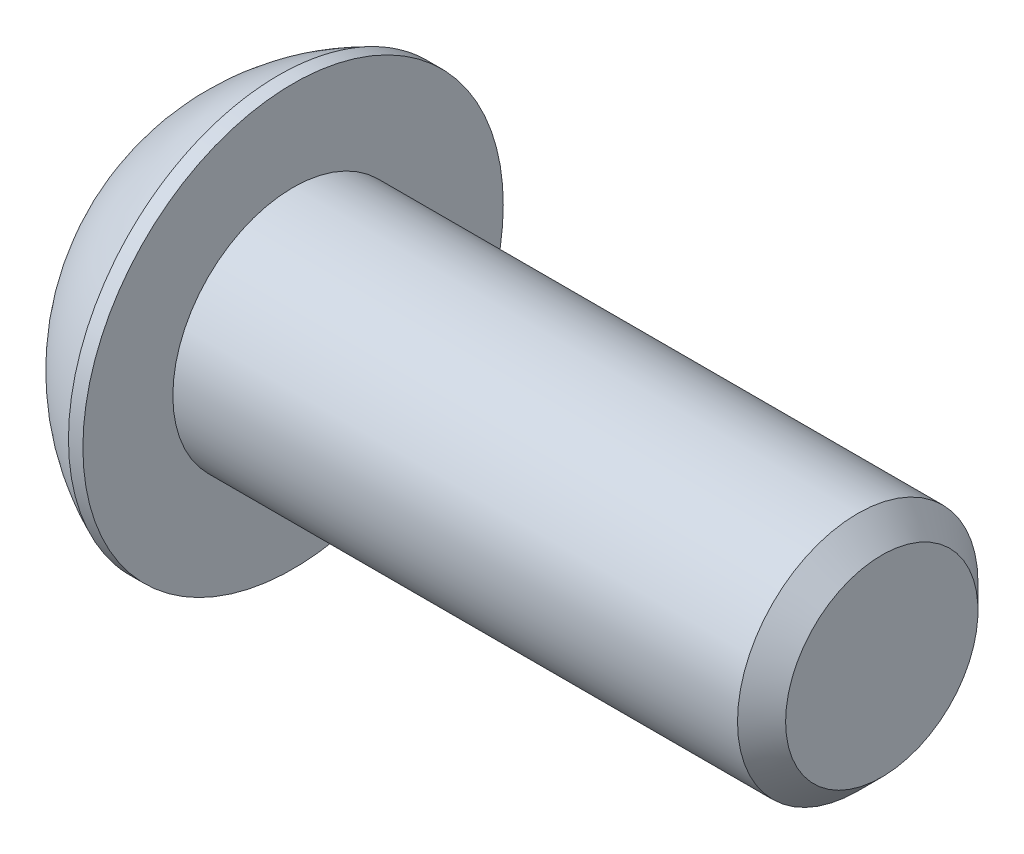
ISO-10303-21;
HEADER;
FILE_DESCRIPTION(('STEP AP214'),'2;1');
FILE_NAME('part.step','',(''),(''),'','','');
FILE_SCHEMA(('AUTOMOTIVE_DESIGN { 1 0 10303 214 1 1 1 1 }'));
ENDSEC;
DATA;
#1=APPLICATION_CONTEXT('core data for automotive mechanical design processes');
#2=APPLICATION_PROTOCOL_DEFINITION('international standard','automotive_design',2000,#1);
#3=PRODUCT_CONTEXT('',#1,'mechanical');
#4=PRODUCT('Part','Part','',(#3));
#5=PRODUCT_RELATED_PRODUCT_CATEGORY('part','',(#4));
#6=PRODUCT_DEFINITION_FORMATION('','',#4);
#7=PRODUCT_DEFINITION_CONTEXT('part definition',#1,'design');
#8=PRODUCT_DEFINITION('design','',#6,#7);
#9=PRODUCT_DEFINITION_SHAPE('','',#8);
#10=(LENGTH_UNIT() NAMED_UNIT(*) SI_UNIT(.MILLI.,.METRE.));
#11=(NAMED_UNIT(*) PLANE_ANGLE_UNIT() SI_UNIT($,.RADIAN.));
#12=(NAMED_UNIT(*) SI_UNIT($,.STERADIAN.) SOLID_ANGLE_UNIT());
#13=UNCERTAINTY_MEASURE_WITH_UNIT(LENGTH_MEASURE(1.E-05),#10,'distance_accuracy_value','');
#14=(GEOMETRIC_REPRESENTATION_CONTEXT(3) GLOBAL_UNCERTAINTY_ASSIGNED_CONTEXT((#13)) GLOBAL_UNIT_ASSIGNED_CONTEXT((#10,
#11,#12)) REPRESENTATION_CONTEXT('',''));
#15=CARTESIAN_POINT('',(0.,0.,0.));
#16=DIRECTION('',(0.,0.,1.));
#17=DIRECTION('',(1.,0.,0.));
#18=AXIS2_PLACEMENT_3D('',#15,#16,#17);
#19=CARTESIAN_POINT('',(1.32080000000034,0.,0.));
#20=DIRECTION('',(-1.,0.,0.));
#21=DIRECTION('',(0.,0.,1.));
#22=AXIS2_PLACEMENT_3D('',#19,#20,#21);
#23=CONICAL_SURFACE('',#22,1.1937999999998,1.04719755119608);
#24=CARTESIAN_POINT('',(2.01004075135902,0.,-4.44089209850063E-13));
#25=VERTEX_POINT('',#24);
#26=VERTEX_LOOP('',#25);
#27=FACE_BOUND('',#26,.T.);
#28=CARTESIAN_POINT('',(1.32080000000009,0.,0.));
#29=DIRECTION('',(-1.,0.,0.));
#30=DIRECTION('',(0.,0.,1.));
#31=AXIS2_PLACEMENT_3D('',#28,#29,#30);
#32=CIRCLE('',#31,1.19380000000024);
#33=CARTESIAN_POINT('',(1.32080000000009,0.,1.19380000000024));
#34=VERTEX_POINT('',#33);
#35=EDGE_CURVE('E20',#34,#34,#32,.T.);
#36=ORIENTED_EDGE('',*,*,#35,.T.);
#37=EDGE_LOOP('',(#36));
#38=FACE_BOUND('',#37,.T.);
#39=ADVANCED_FACE('F17',(#27,#38),#23,.F.);
#40=CARTESIAN_POINT('',(1.3208,-2.29135888084633,0.));
#41=DIRECTION('',(1.,0.,0.));
#42=DIRECTION('',(0.,0.,-1.));
#43=AXIS2_PLACEMENT_3D('',#40,#41,#42);
#44=PLANE('',#43);
#45=DIRECTION('',(0.,1.,0.));
#46=VECTOR('',#45,1.);
#47=CARTESIAN_POINT('',(1.3208,-1.14567944042316,1.984375));
#48=LINE('',#47,#46);
#49=CARTESIAN_POINT('',(1.3208,1.14567944042316,1.984375));
#50=VERTEX_POINT('',#49);
#51=CARTESIAN_POINT('',(1.3208,-1.14567944042316,1.984375));
#52=VERTEX_POINT('',#51);
#53=EDGE_CURVE('E69',#50,#52,#48,.F.);
#54=ORIENTED_EDGE('',*,*,#53,.F.);
#55=DIRECTION('',(0.,0.5,-0.866025403784439));
#56=VECTOR('',#55,1.);
#57=CARTESIAN_POINT('',(1.3208,1.14567944042316,1.984375));
#58=LINE('',#57,#56);
#59=CARTESIAN_POINT('',(1.3208,2.29135888084633,0.));
#60=VERTEX_POINT('',#59);
#61=EDGE_CURVE('E287',#60,#50,#58,.F.);
#62=ORIENTED_EDGE('',*,*,#61,.F.);
#63=DIRECTION('',(0.,-0.5,-0.866025403784439));
#64=VECTOR('',#63,1.);
#65=CARTESIAN_POINT('',(1.3208,2.29135888084633,0.));
#66=LINE('',#65,#64);
#67=CARTESIAN_POINT('',(1.3208,1.14567944042316,-1.984375));
#68=VERTEX_POINT('',#67);
#69=EDGE_CURVE('E291',#68,#60,#66,.F.);
#70=ORIENTED_EDGE('',*,*,#69,.F.);
#71=DIRECTION('',(0.,1.,0.));
#72=VECTOR('',#71,1.);
#73=CARTESIAN_POINT('',(1.3208,1.14567944042316,-1.984375));
#74=LINE('',#73,#72);
#75=CARTESIAN_POINT('',(1.3208,-1.14567944042316,-1.984375));
#76=VERTEX_POINT('',#75);
#77=EDGE_CURVE('E296',#76,#68,#74,.T.);
#78=ORIENTED_EDGE('',*,*,#77,.F.);
#79=DIRECTION('',(0.,-0.500000000000001,0.866025403784438));
#80=VECTOR('',#79,1.);
#81=CARTESIAN_POINT('',(1.3208,-1.14567944042316,-1.984375));
#82=LINE('',#81,#80);
#83=CARTESIAN_POINT('',(1.3208,-2.29135888084633,0.));
#84=VERTEX_POINT('',#83);
#85=EDGE_CURVE('E301',#84,#76,#82,.F.);
#86=ORIENTED_EDGE('',*,*,#85,.F.);
#87=DIRECTION('',(0.,0.500000000000001,0.866025403784438));
#88=VECTOR('',#87,1.);
#89=CARTESIAN_POINT('',(1.3208,-2.29135888084633,0.));
#90=LINE('',#89,#88);
#91=EDGE_CURVE('E82',#52,#84,#90,.F.);
#92=ORIENTED_EDGE('',*,*,#91,.F.);
#93=EDGE_LOOP('',(#54,#62,#70,#78,#86,#92));
#94=FACE_BOUND('',#93,.T.);
#95=ORIENTED_EDGE('',*,*,#35,.F.);
#96=EDGE_LOOP('',(#95));
#97=FACE_BOUND('',#96,.T.);
#98=ADVANCED_FACE('F75',(#94,#97),#44,.F.);
#99=CARTESIAN_POINT('',(1.3208,-1.14567944042316,1.984375));
#100=DIRECTION('',(0.,0.,-1.));
#101=DIRECTION('',(0.,1.,0.));
#102=AXIS2_PLACEMENT_3D('',#99,#100,#101);
#103=PLANE('',#102);
#104=ORIENTED_EDGE('',*,*,#53,.T.);
#105=DIRECTION('',(1.,0.,0.));
#106=VECTOR('',#105,1.);
#107=CARTESIAN_POINT('',(1.3208,-1.14567944042316,1.984375));
#108=LINE('',#107,#106);
#109=CARTESIAN_POINT('',(0.,-1.14567944042316,1.984375));
#110=VERTEX_POINT('',#109);
#111=EDGE_CURVE('E79',#110,#52,#108,.T.);
#112=ORIENTED_EDGE('',*,*,#111,.F.);
#113=DIRECTION('',(0.,1.,0.));
#114=VECTOR('',#113,1.);
#115=CARTESIAN_POINT('',(0.,0.,1.984375));
#116=LINE('',#115,#114);
#117=CARTESIAN_POINT('',(0.,1.14567944042316,1.984375));
#118=VERTEX_POINT('',#117);
#119=EDGE_CURVE('E281',#118,#110,#116,.F.);
#120=ORIENTED_EDGE('',*,*,#119,.F.);
#121=DIRECTION('',(1.,0.,0.));
#122=VECTOR('',#121,1.);
#123=CARTESIAN_POINT('',(1.3208,1.14567944042316,1.984375));
#124=LINE('',#123,#122);
#125=EDGE_CURVE('E284',#50,#118,#124,.F.);
#126=ORIENTED_EDGE('',*,*,#125,.F.);
#127=EDGE_LOOP('',(#104,#112,#120,#126));
#128=FACE_BOUND('',#127,.T.);
#129=ADVANCED_FACE('F128',(#128),#103,.T.);
#130=CARTESIAN_POINT('',(1.3208,-2.29135888084633,0.));
#131=DIRECTION('',(0.,0.866025403784438,-0.500000000000001));
#132=DIRECTION('',(0.,0.500000000000001,0.866025403784438));
#133=AXIS2_PLACEMENT_3D('',#130,#131,#132);
#134=PLANE('',#133);
#135=ORIENTED_EDGE('',*,*,#91,.T.);
#136=DIRECTION('',(1.,0.,0.));
#137=VECTOR('',#136,1.);
#138=CARTESIAN_POINT('',(1.3208,-2.29135888084633,0.));
#139=LINE('',#138,#137);
#140=CARTESIAN_POINT('',(0.,-2.29135888084633,0.));
#141=VERTEX_POINT('',#140);
#142=EDGE_CURVE('E303',#141,#84,#139,.T.);
#143=ORIENTED_EDGE('',*,*,#142,.F.);
#144=DIRECTION('',(0.,-0.500000000000001,-0.866025403784438));
#145=VECTOR('',#144,1.);
#146=CARTESIAN_POINT('',(0.,-1.14567944042316,1.984375));
#147=LINE('',#146,#145);
#148=EDGE_CURVE('E278',#110,#141,#147,.T.);
#149=ORIENTED_EDGE('',*,*,#148,.F.);
#150=ORIENTED_EDGE('',*,*,#111,.T.);
#151=EDGE_LOOP('',(#135,#143,#149,#150));
#152=FACE_BOUND('',#151,.T.);
#153=ADVANCED_FACE('F124',(#152),#134,.T.);
#154=CARTESIAN_POINT('',(1.3208,-1.14567944042316,-1.984375));
#155=DIRECTION('',(0.,0.866025403784438,0.500000000000001));
#156=DIRECTION('',(0.,-0.500000000000001,0.866025403784438));
#157=AXIS2_PLACEMENT_3D('',#154,#155,#156);
#158=PLANE('',#157);
#159=ORIENTED_EDGE('',*,*,#85,.T.);
#160=DIRECTION('',(1.,0.,0.));
#161=VECTOR('',#160,1.);
#162=CARTESIAN_POINT('',(1.3208,-1.14567944042316,-1.984375));
#163=LINE('',#162,#161);
#164=CARTESIAN_POINT('',(0.,-1.14567944042316,-1.984375));
#165=VERTEX_POINT('',#164);
#166=EDGE_CURVE('E298',#165,#76,#163,.T.);
#167=ORIENTED_EDGE('',*,*,#166,.F.);
#168=DIRECTION('',(0.,0.500000000000001,-0.866025403784438));
#169=VECTOR('',#168,1.);
#170=CARTESIAN_POINT('',(0.,-2.29135888084633,0.));
#171=LINE('',#170,#169);
#172=EDGE_CURVE('E275',#141,#165,#171,.T.);
#173=ORIENTED_EDGE('',*,*,#172,.F.);
#174=ORIENTED_EDGE('',*,*,#142,.T.);
#175=EDGE_LOOP('',(#159,#167,#173,#174));
#176=FACE_BOUND('',#175,.T.);
#177=ADVANCED_FACE('F120',(#176),#158,.T.);
#178=CARTESIAN_POINT('',(1.3208,1.14567944042316,-1.984375));
#179=DIRECTION('',(0.,0.,1.));
#180=DIRECTION('',(1.,0.,0.));
#181=AXIS2_PLACEMENT_3D('',#178,#179,#180);
#182=PLANE('',#181);
#183=ORIENTED_EDGE('',*,*,#77,.T.);
#184=DIRECTION('',(1.,0.,0.));
#185=VECTOR('',#184,1.);
#186=CARTESIAN_POINT('',(1.3208,1.14567944042316,-1.984375));
#187=LINE('',#186,#185);
#188=CARTESIAN_POINT('',(0.,1.14567944042316,-1.984375));
#189=VERTEX_POINT('',#188);
#190=EDGE_CURVE('E293',#189,#68,#187,.T.);
#191=ORIENTED_EDGE('',*,*,#190,.F.);
#192=DIRECTION('',(0.,1.,0.));
#193=VECTOR('',#192,1.);
#194=CARTESIAN_POINT('',(0.,0.,-1.984375));
#195=LINE('',#194,#193);
#196=EDGE_CURVE('E272',#165,#189,#195,.T.);
#197=ORIENTED_EDGE('',*,*,#196,.F.);
#198=ORIENTED_EDGE('',*,*,#166,.T.);
#199=EDGE_LOOP('',(#183,#191,#197,#198));
#200=FACE_BOUND('',#199,.T.);
#201=ADVANCED_FACE('F117',(#200),#182,.T.);
#202=CARTESIAN_POINT('',(1.3208,2.29135888084633,0.));
#203=DIRECTION('',(0.,-0.866025403784439,0.5));
#204=DIRECTION('',(0.,-0.5,-0.866025403784439));
#205=AXIS2_PLACEMENT_3D('',#202,#203,#204);
#206=PLANE('',#205);
#207=ORIENTED_EDGE('',*,*,#69,.T.);
#208=DIRECTION('',(1.,0.,0.));
#209=VECTOR('',#208,1.);
#210=CARTESIAN_POINT('',(1.3208,2.29135888084633,0.));
#211=LINE('',#210,#209);
#212=CARTESIAN_POINT('',(0.,2.29135888084633,0.));
#213=VERTEX_POINT('',#212);
#214=EDGE_CURVE('E35',#213,#60,#211,.T.);
#215=ORIENTED_EDGE('',*,*,#214,.F.);
#216=DIRECTION('',(0.,0.5,0.866025403784439));
#217=VECTOR('',#216,1.);
#218=CARTESIAN_POINT('',(0.,1.14567944042316,-1.984375));
#219=LINE('',#218,#217);
#220=EDGE_CURVE('E269',#189,#213,#219,.T.);
#221=ORIENTED_EDGE('',*,*,#220,.F.);
#222=ORIENTED_EDGE('',*,*,#190,.T.);
#223=EDGE_LOOP('',(#207,#215,#221,#222));
#224=FACE_BOUND('',#223,.T.);
#225=ADVANCED_FACE('F113',(#224),#206,.T.);
#226=CARTESIAN_POINT('',(1.3208,1.14567944042316,1.984375));
#227=DIRECTION('',(0.,-0.866025403784439,-0.5));
#228=DIRECTION('',(0.,0.5,-0.866025403784439));
#229=AXIS2_PLACEMENT_3D('',#226,#227,#228);
#230=PLANE('',#229);
#231=ORIENTED_EDGE('',*,*,#61,.T.);
#232=ORIENTED_EDGE('',*,*,#125,.T.);
#233=DIRECTION('',(0.,-0.5,0.866025403784438));
#234=VECTOR('',#233,1.);
#235=CARTESIAN_POINT('',(0.,2.29135888084633,0.));
#236=LINE('',#235,#234);
#237=EDGE_CURVE('E100',#213,#118,#236,.T.);
#238=ORIENTED_EDGE('',*,*,#237,.F.);
#239=ORIENTED_EDGE('',*,*,#214,.T.);
#240=EDGE_LOOP('',(#231,#232,#238,#239));
#241=FACE_BOUND('',#240,.T.);
#242=ADVANCED_FACE('F109',(#241),#230,.T.);
#243=CARTESIAN_POINT('',(0.,0.,0.));
#244=DIRECTION('',(-1.,0.,0.));
#245=DIRECTION('',(0.,0.,1.));
#246=AXIS2_PLACEMENT_3D('',#243,#244,#245);
#247=PLANE('',#246);
#248=ORIENTED_EDGE('',*,*,#220,.T.);
#249=ORIENTED_EDGE('',*,*,#237,.T.);
#250=ORIENTED_EDGE('',*,*,#119,.T.);
#251=ORIENTED_EDGE('',*,*,#148,.T.);
#252=ORIENTED_EDGE('',*,*,#172,.T.);
#253=ORIENTED_EDGE('',*,*,#196,.T.);
#254=EDGE_LOOP('',(#248,#249,#250,#251,#252,#253));
#255=FACE_BOUND('',#254,.T.);
#256=CARTESIAN_POINT('',(0.,2.77495,0.));
#257=CARTESIAN_POINT('',(0.,2.77494953309947,0.0779118937523459));
#258=CARTESIAN_POINT('',(0.,2.77166578388025,0.15583810591977));
#259=CARTESIAN_POINT('',(0.,2.75855213600204,0.311152012455904));
#260=CARTESIAN_POINT('',(0.,2.74872030471467,0.388539541019556));
#261=CARTESIAN_POINT('',(0.,2.72255472645676,0.542341518735717));
#262=CARTESIAN_POINT('',(-2.70414110576258E-13,2.70621065843663,0.618754223567578));
#263=CARTESIAN_POINT('',(2.71501725221868E-13,2.66713326915777,0.769973634286023));
#264=CARTESIAN_POINT('',(1.01274952524446E-12,2.64439476297869,0.844778983646282));
#265=CARTESIAN_POINT('',(1.81909959813207E-12,2.56690195943351,1.06566239301792));
#266=CARTESIAN_POINT('',(4.77081687541822E-13,2.50280672569928,1.20857954243987));
#267=CARTESIAN_POINT('',(-4.76232447128612E-13,2.35149826934097,1.48160874561538));
#268=CARTESIAN_POINT('',(0.,2.26428416790397,1.61172031233499));
#269=CARTESIAN_POINT('',(0.,2.1181093928834,1.79445660654268));
#270=CARTESIAN_POINT('',(0.,2.06678693791626,1.85333128513996));
#271=CARTESIAN_POINT('',(0.,1.95940522984449,1.96650727912792));
#272=CARTESIAN_POINT('',(0.,1.90335059143535,2.02081294920044));
#273=CARTESIAN_POINT('',(0.,1.78683891013963,2.12453280878582));
#274=CARTESIAN_POINT('',(0.,1.72637988450322,2.1739447713554));
#275=CARTESIAN_POINT('',(0.,1.60151968865711,2.26750481692908));
#276=CARTESIAN_POINT('',(0.,1.53711760864537,2.31165167810847));
#277=CARTESIAN_POINT('',(0.,1.33869902291632,2.43567242603944));
#278=CARTESIAN_POINT('',(0.,1.19934704110695,2.507235886628));
#279=CARTESIAN_POINT('',(0.,0.910681609121881,2.62590828672821));
#280=CARTESIAN_POINT('',(0.,0.761368265357398,2.67301748742278));
#281=CARTESIAN_POINT('',(0.,0.456932649466623,2.74151230664007));
#282=CARTESIAN_POINT('',(0.,0.301810346322584,2.76289778778721));
#283=CARTESIAN_POINT('',(0.,-0.00982263870895171,2.77931595661156));
#284=CARTESIAN_POINT('',(0.,-0.166333320596448,2.77434864428877));
#285=CARTESIAN_POINT('',(0.,-0.476280836814452,2.73822217653073));
#286=CARTESIAN_POINT('',(0.,-0.629717687555985,2.70706316096981));
#287=CARTESIAN_POINT('',(0.,-0.929254830044274,2.61937980771149));
#288=CARTESIAN_POINT('',(0.,-1.0753550434132,2.56285519909568));
#289=CARTESIAN_POINT('',(0.,-1.28570692598579,2.46037024128109));
#290=CARTESIAN_POINT('',(0.,-1.35439130022287,2.42323494812896));
#291=CARTESIAN_POINT('',(0.,-1.488391287199,2.34331277270256));
#292=CARTESIAN_POINT('',(0.,-1.55370767631787,2.30052720108831));
#293=CARTESIAN_POINT('',(0.,-1.68047292776594,2.20962421887055));
#294=CARTESIAN_POINT('',(0.,-1.7419235278682,2.16150923122348));
#295=CARTESIAN_POINT('',(0.,-1.86060297067992,2.06024311301283));
#296=CARTESIAN_POINT('',(0.,-1.91782768181715,2.0070871669763));
#297=CARTESIAN_POINT('',(0.,-2.08239462196651,1.8407220856554));
#298=CARTESIAN_POINT('',(0.,-2.18279764272601,1.72049499758422));
#299=CARTESIAN_POINT('',(0.,-2.36195754944063,1.46487629213018));
#300=CARTESIAN_POINT('',(0.,-2.44071525816758,1.32948525142807));
#301=CARTESIAN_POINT('',(0.,-2.54098882695274,1.11796734074395));
#302=CARTESIAN_POINT('',(0.,-2.57146177392727,1.04596540008347));
#303=CARTESIAN_POINT('',(0.,-2.62621251108999,0.899689259475764));
#304=CARTESIAN_POINT('',(0.,-2.65049531495563,0.825416953360952));
#305=CARTESIAN_POINT('',(0.,-2.69267708798766,0.675215808695207));
#306=CARTESIAN_POINT('',(0.,-2.71058613777937,0.599289789313092));
#307=CARTESIAN_POINT('',(0.,-2.73994710360127,0.446213628496932));
#308=CARTESIAN_POINT('',(0.,-2.75140092413871,0.369063855024788));
#309=CARTESIAN_POINT('',(0.,-2.76470470685522,0.24316208817343));
#310=CARTESIAN_POINT('',(0.,-2.76854547596618,0.194611672428577));
#311=CARTESIAN_POINT('',(0.,-2.77366826843264,0.0973760351839812));
#312=CARTESIAN_POINT('',(0.,-2.77495029178814,0.0486908136842395));
#313=CARTESIAN_POINT('',(0.,-2.77494953309947,-0.0779118937523475));
#314=CARTESIAN_POINT('',(0.,-2.77166578388025,-0.155838105919772));
#315=CARTESIAN_POINT('',(0.,-2.75855213600204,-0.311152012455906));
#316=CARTESIAN_POINT('',(0.,-2.74872030471467,-0.388539541019558));
#317=CARTESIAN_POINT('',(0.,-2.72255472645677,-0.542341518735719));
#318=CARTESIAN_POINT('',(-2.70149297926331E-13,-2.70621065843663,-0.61875422356758));
#319=CARTESIAN_POINT('',(2.712366972268E-13,-2.66713326915777,-0.769973634286024));
#320=CARTESIAN_POINT('',(1.0114146773846E-12,-2.64439476297869,-0.844778983646283));
#321=CARTESIAN_POINT('',(1.81656702958366E-12,-2.5669019594335,-1.06566239301792));
#322=CARTESIAN_POINT('',(4.7641829195856E-13,-2.50280672569928,-1.20857954243988));
#323=CARTESIAN_POINT('',(-4.75569026324205E-13,-2.35149826934097,-1.48160874561538));
#324=CARTESIAN_POINT('',(0.,-2.26428416790396,-1.61172031233499));
#325=CARTESIAN_POINT('',(0.,-2.1181093928834,-1.79445660654268));
#326=CARTESIAN_POINT('',(0.,-2.06678693791626,-1.85333128513997));
#327=CARTESIAN_POINT('',(0.,-1.95940522984449,-1.96650727912792));
#328=CARTESIAN_POINT('',(0.,-1.90335059143535,-2.02081294920044));
#329=CARTESIAN_POINT('',(0.,-1.78683891013963,-2.12453280878582));
#330=CARTESIAN_POINT('',(0.,-1.72637988450322,-2.1739447713554));
#331=CARTESIAN_POINT('',(0.,-1.60151968865711,-2.26750481692908));
#332=CARTESIAN_POINT('',(0.,-1.53711760864537,-2.31165167810847));
#333=CARTESIAN_POINT('',(0.,-1.33869902291632,-2.43567242603944));
#334=CARTESIAN_POINT('',(0.,-1.19934704110695,-2.507235886628));
#335=CARTESIAN_POINT('',(0.,-0.91068160912188,-2.62590828672821));
#336=CARTESIAN_POINT('',(0.,-0.761368265357396,-2.67301748742278));
#337=CARTESIAN_POINT('',(0.,-0.456932649466621,-2.74151230664007));
#338=CARTESIAN_POINT('',(0.,-0.301810346322582,-2.76289778778721));
#339=CARTESIAN_POINT('',(0.,0.00982263870895353,-2.77931595661156));
#340=CARTESIAN_POINT('',(0.,0.16633332059645,-2.77434864428876));
#341=CARTESIAN_POINT('',(0.,0.476280836814454,-2.73822217653073));
#342=CARTESIAN_POINT('',(0.,0.629717687555987,-2.70706316096981));
#343=CARTESIAN_POINT('',(0.,0.929254830044276,-2.6193798077115));
#344=CARTESIAN_POINT('',(0.,1.0753550434132,-2.56285519909568));
#345=CARTESIAN_POINT('',(0.,1.28570692598579,-2.46037024128109));
#346=CARTESIAN_POINT('',(0.,1.35439130022287,-2.42323494812896));
#347=CARTESIAN_POINT('',(0.,1.488391287199,-2.34331277270256));
#348=CARTESIAN_POINT('',(0.,1.55370767631787,-2.30052720108831));
#349=CARTESIAN_POINT('',(0.,1.68047292776594,-2.20962421887055));
#350=CARTESIAN_POINT('',(0.,1.7419235278682,-2.16150923122348));
#351=CARTESIAN_POINT('',(0.,1.86060297067992,-2.06024311301282));
#352=CARTESIAN_POINT('',(0.,1.91782768181716,-2.0070871669763));
#353=CARTESIAN_POINT('',(0.,2.08239462196651,-1.8407220856554));
#354=CARTESIAN_POINT('',(0.,2.18279764272601,-1.72049499758422));
#355=CARTESIAN_POINT('',(0.,2.36195754944063,-1.46487629213018));
#356=CARTESIAN_POINT('',(0.,2.44071525816757,-1.32948525142807));
#357=CARTESIAN_POINT('',(0.,2.54098882695273,-1.11796734074395));
#358=CARTESIAN_POINT('',(0.,2.57146177392727,-1.04596540008347));
#359=CARTESIAN_POINT('',(0.,2.62621251108999,-0.899689259475765));
#360=CARTESIAN_POINT('',(0.,2.65049531495563,-0.825416953360953));
#361=CARTESIAN_POINT('',(0.,2.69267708798766,-0.675215808695207));
#362=CARTESIAN_POINT('',(0.,2.71058613777936,-0.599289789313092));
#363=CARTESIAN_POINT('',(0.,2.73994710360127,-0.446213628496932));
#364=CARTESIAN_POINT('',(0.,2.75140092413871,-0.369063855024789));
#365=CARTESIAN_POINT('',(0.,2.76470470685522,-0.243162088173432));
#366=CARTESIAN_POINT('',(0.,2.76854547596618,-0.194611672428578));
#367=CARTESIAN_POINT('',(0.,2.77366826843264,-0.0973760351839823));
#368=CARTESIAN_POINT('',(0.,2.77495029178814,-0.0486908136842408));
#369=CARTESIAN_POINT('',(0.,2.77495,0.));
#370=B_SPLINE_CURVE_WITH_KNOTS('',3,(#256,#257,#258,#259,#260,#261,#262,#263,#264,#265,#266,
#267,#268,#269,#270,#271,#272,#273,#274,#275,#276,#277,#278,#279,#280,#281,#282,#283,#284,#285,
#286,#287,#288,#289,#290,#291,#292,#293,#294,#295,#296,#297,#298,#299,#300,#301,#302,#303,#304,
#305,#306,#307,#308,#309,#310,#311,#312,#313,#314,#315,#316,#317,#318,#319,#320,#321,#322,#323,
#324,#325,#326,#327,#328,#329,#330,#331,#332,#333,#334,#335,#336,#337,#338,#339,#340,#341,#342,
#343,#344,#345,#346,#347,#348,#349,#350,#351,#352,#353,#354,#355,#356,#357,#358,#359,#360,#361,
#362,#363,#364,#365,#366,#367,#368,#369),.UNSPECIFIED.,.T.,.F.,(4,2,2,2,2,2,2,2,2,2,2,2,2,2,2,2,
2,2,2,2,2,2,2,2,2,2,2,2,2,2,2,2,2,2,2,2,2,2,2,2,2,2,2,2,2,2,2,2,2,2,2,2,2,2,2,2,4),(0.,
0.233690856748162,0.467450716578751,0.701582538521471,0.935904756015414,1.40343220467667,
1.87097742791502,2.10505636898837,2.33890962270652,2.57286880998746,2.80688218486306,
3.27442101763127,3.74195485676357,4.20949119271389,4.67702752866417,5.14456136779641,
5.61210020056468,5.84611357544033,6.08007276272136,6.31392601643949,6.54800495751273,
7.01555018075072,7.48307762941212,7.71739984690652,7.95153166884955,8.18529152868023,
8.41898238542855,8.56502681353347,8.71107124163843,8.94476209838659,9.17852195821718,
9.4126537801599,9.64697599765384,10.1145034463151,10.5820486695534,10.8161276106268,
11.0499808643449,11.2839400516259,11.5179534265015,11.9854922592697,12.453026098402,
12.9205624343523,13.3880987703026,13.8556326094348,14.3231714422031,14.5571848170788,
14.7911440043598,15.0249972580779,15.2590761991512,15.7266214223891,16.1941488710506,
16.4284710885449,16.662602910488,16.8963627703186,17.130053627067,17.2760980551719,
17.4221424832769),.UNSPECIFIED.);
#371=CARTESIAN_POINT('',(0.,2.77495,0.));
#372=VERTEX_POINT('',#371);
#373=EDGE_CURVE('E94',#372,#372,#370,.T.);
#374=ORIENTED_EDGE('',*,*,#373,.F.);
#375=EDGE_LOOP('',(#374));
#376=FACE_BOUND('',#375,.T.);
#377=ADVANCED_FACE('F105',(#255,#376),#247,.T.);
#378=CARTESIAN_POINT('',(5.37260881410256,0.,0.));
#379=DIRECTION('',(0.,1.,0.));
#380=DIRECTION('',(1.,0.,0.));
#381=AXIS2_PLACEMENT_3D('',#378,#379,#380);
#382=SPHERICAL_SURFACE('',#381,6.04692260342999);
#383=CARTESIAN_POINT('',(2.9718,0.,0.));
#384=DIRECTION('',(-1.,0.,0.));
#385=DIRECTION('',(0.,0.,1.));
#386=AXIS2_PLACEMENT_3D('',#383,#384,#385);
#387=CIRCLE('',#386,5.5499);
#388=CARTESIAN_POINT('',(2.9718,0.,5.5499));
#389=VERTEX_POINT('',#388);
#390=EDGE_CURVE('E92',#389,#389,#387,.F.);
#391=ORIENTED_EDGE('',*,*,#390,.F.);
#392=EDGE_LOOP('',(#391));
#393=FACE_BOUND('',#392,.T.);
#394=ORIENTED_EDGE('',*,*,#373,.T.);
#395=EDGE_LOOP('',(#394));
#396=FACE_BOUND('',#395,.T.);
#397=ADVANCED_FACE('F101',(#393,#396),#382,.T.);
#398=CARTESIAN_POINT('',(18.8976,0.,0.));
#399=DIRECTION('',(-1.,0.,0.));
#400=DIRECTION('',(0.,0.,1.));
#401=AXIS2_PLACEMENT_3D('',#398,#399,#400);
#402=PLANE('',#401);
#403=CARTESIAN_POINT('',(18.8976000000025,0.,0.));
#404=DIRECTION('',(-1.,0.,0.));
#405=DIRECTION('',(0.,0.,1.));
#406=AXIS2_PLACEMENT_3D('',#403,#404,#405);
#407=CIRCLE('',#406,2.54000000006727);
#408=CARTESIAN_POINT('',(18.8976000000025,0.,2.54000000006727));
#409=VERTEX_POINT('',#408);
#410=EDGE_CURVE('E89',#409,#409,#407,.T.);
#411=ORIENTED_EDGE('',*,*,#410,.F.);
#412=EDGE_LOOP('',(#411));
#413=FACE_BOUND('',#412,.T.);
#414=ADVANCED_FACE('F154',(#413),#402,.F.);
#415=CARTESIAN_POINT('',(0.,0.,0.));
#416=DIRECTION('',(-1.,0.,0.));
#417=DIRECTION('',(0.,0.,1.));
#418=AXIS2_PLACEMENT_3D('',#415,#416,#417);
#419=CYLINDRICAL_SURFACE('',#418,5.5499);
#420=ORIENTED_EDGE('',*,*,#390,.T.);
#421=EDGE_LOOP('',(#420));
#422=FACE_BOUND('',#421,.T.);
#423=CARTESIAN_POINT('',(3.3528,0.,0.));
#424=DIRECTION('',(-1.,0.,0.));
#425=DIRECTION('',(0.,0.,1.));
#426=AXIS2_PLACEMENT_3D('',#423,#424,#425);
#427=CIRCLE('',#426,5.5499);
#428=CARTESIAN_POINT('',(3.3528,0.,5.5499));
#429=VERTEX_POINT('',#428);
#430=EDGE_CURVE('E86',#429,#429,#427,.T.);
#431=ORIENTED_EDGE('',*,*,#430,.T.);
#432=EDGE_LOOP('',(#431));
#433=FACE_BOUND('',#432,.T.);
#434=ADVANCED_FACE('F151',(#422,#433),#419,.T.);
#435=CARTESIAN_POINT('',(18.2626000000141,0.,0.));
#436=DIRECTION('',(-1.,0.,0.));
#437=DIRECTION('',(0.,0.,1.));
#438=AXIS2_PLACEMENT_3D('',#435,#436,#437);
#439=CONICAL_SURFACE('',#438,3.17499999999882,0.78539816335269);
#440=CARTESIAN_POINT('',(18.2626,0.,0.));
#441=DIRECTION('',(-1.,0.,0.));
#442=DIRECTION('',(0.,0.,1.));
#443=AXIS2_PLACEMENT_3D('',#440,#441,#442);
#444=CIRCLE('',#443,3.175);
#445=CARTESIAN_POINT('',(18.2626,0.,3.175));
#446=VERTEX_POINT('',#445);
#447=EDGE_CURVE('E26',#446,#446,#444,.T.);
#448=ORIENTED_EDGE('',*,*,#447,.F.);
#449=EDGE_LOOP('',(#448));
#450=FACE_BOUND('',#449,.T.);
#451=ORIENTED_EDGE('',*,*,#410,.T.);
#452=EDGE_LOOP('',(#451));
#453=FACE_BOUND('',#452,.T.);
#454=ADVANCED_FACE('F144',(#450,#453),#439,.T.);
#455=CARTESIAN_POINT('',(3.3528,3.175,0.));
#456=DIRECTION('',(-1.,0.,0.));
#457=DIRECTION('',(0.,0.,1.));
#458=AXIS2_PLACEMENT_3D('',#455,#456,#457);
#459=PLANE('',#458);
#460=CARTESIAN_POINT('',(3.3528,0.,0.));
#461=DIRECTION('',(-1.,0.,0.));
#462=DIRECTION('',(0.,0.,1.));
#463=AXIS2_PLACEMENT_3D('',#460,#461,#462);
#464=CIRCLE('',#463,3.175);
#465=CARTESIAN_POINT('',(3.3528,0.,3.175));
#466=VERTEX_POINT('',#465);
#467=EDGE_CURVE('E11',#466,#466,#464,.F.);
#468=ORIENTED_EDGE('',*,*,#467,.F.);
#469=EDGE_LOOP('',(#468));
#470=FACE_BOUND('',#469,.T.);
#471=ORIENTED_EDGE('',*,*,#430,.F.);
#472=EDGE_LOOP('',(#471));
#473=FACE_BOUND('',#472,.T.);
#474=ADVANCED_FACE('F138',(#470,#473),#459,.F.);
#475=CARTESIAN_POINT('',(0.,0.,0.));
#476=DIRECTION('',(-1.,0.,0.));
#477=DIRECTION('',(0.,0.,1.));
#478=AXIS2_PLACEMENT_3D('',#475,#476,#477);
#479=CYLINDRICAL_SURFACE('',#478,3.175);
#480=ORIENTED_EDGE('',*,*,#467,.T.);
#481=EDGE_LOOP('',(#480));
#482=FACE_BOUND('',#481,.T.);
#483=ORIENTED_EDGE('',*,*,#447,.T.);
#484=EDGE_LOOP('',(#483));
#485=FACE_BOUND('',#484,.T.);
#486=ADVANCED_FACE('F136',(#482,#485),#479,.T.);
#487=CLOSED_SHELL('',(#39,#98,#129,#153,#177,#201,#225,#242,#377,#397,#414,#434,#454,#474,#486));
#488=MANIFOLD_SOLID_BREP('B1',#487);
#489=ADVANCED_BREP_SHAPE_REPRESENTATION('',(#18,#488),#14);
#490=SHAPE_DEFINITION_REPRESENTATION(#9,#489);
ENDSEC;
END-ISO-10303-21;
